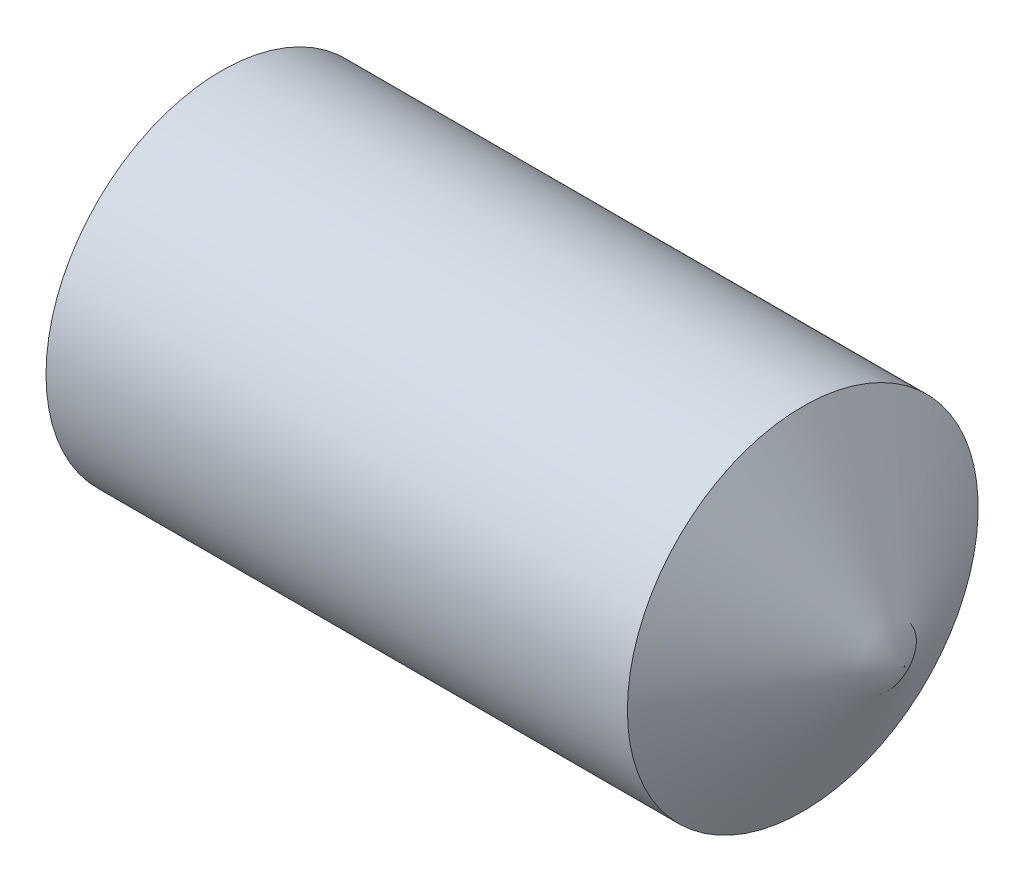
ISO-10303-21;
HEADER;
FILE_DESCRIPTION(('STEP AP214'),'2;1');
FILE_NAME('part.step','',(''),(''),'','','');
FILE_SCHEMA(('AUTOMOTIVE_DESIGN { 1 0 10303 214 1 1 1 1 }'));
ENDSEC;
DATA;
#1=APPLICATION_CONTEXT('core data for automotive mechanical design processes');
#2=APPLICATION_PROTOCOL_DEFINITION('international standard','automotive_design',2000,#1);
#3=PRODUCT_CONTEXT('',#1,'mechanical');
#4=PRODUCT('Part','Part','',(#3));
#5=PRODUCT_RELATED_PRODUCT_CATEGORY('part','',(#4));
#6=PRODUCT_DEFINITION_FORMATION('','',#4);
#7=PRODUCT_DEFINITION_CONTEXT('part definition',#1,'design');
#8=PRODUCT_DEFINITION('design','',#6,#7);
#9=PRODUCT_DEFINITION_SHAPE('','',#8);
#10=(LENGTH_UNIT() NAMED_UNIT(*) SI_UNIT(.MILLI.,.METRE.));
#11=(NAMED_UNIT(*) PLANE_ANGLE_UNIT() SI_UNIT($,.RADIAN.));
#12=(NAMED_UNIT(*) SI_UNIT($,.STERADIAN.) SOLID_ANGLE_UNIT());
#13=UNCERTAINTY_MEASURE_WITH_UNIT(LENGTH_MEASURE(1.E-05),#10,'distance_accuracy_value','');
#14=(GEOMETRIC_REPRESENTATION_CONTEXT(3) GLOBAL_UNCERTAINTY_ASSIGNED_CONTEXT((#13)) GLOBAL_UNIT_ASSIGNED_CONTEXT((#10,
#11,#12)) REPRESENTATION_CONTEXT('',''));
#15=CARTESIAN_POINT('',(0.,0.,0.));
#16=DIRECTION('',(0.,0.,1.));
#17=DIRECTION('',(1.,0.,0.));
#18=AXIS2_PLACEMENT_3D('',#15,#16,#17);
#19=CARTESIAN_POINT('',(0.,0.,0.));
#20=DIRECTION('',(-1.,0.,0.));
#21=DIRECTION('',(0.,0.,1.));
#22=AXIS2_PLACEMENT_3D('',#19,#20,#21);
#23=PLANE('',#22);
#24=CARTESIAN_POINT('',(0.,0.,0.));
#25=DIRECTION('',(-1.,0.,0.));
#26=DIRECTION('',(0.,0.,1.));
#27=AXIS2_PLACEMENT_3D('',#24,#25,#26);
#28=CIRCLE('',#27,1.2195);
#29=CARTESIAN_POINT('',(0.,0.,1.2195));
#30=VERTEX_POINT('',#29);
#31=EDGE_CURVE('E11',#30,#30,#28,.T.);
#32=ORIENTED_EDGE('',*,*,#31,.T.);
#33=EDGE_LOOP('',(#32));
#34=FACE_BOUND('',#33,.T.);
#35=DIRECTION('',(0.,0.,-1.));
#36=VECTOR('',#35,1.);
#37=CARTESIAN_POINT('',(0.,0.750000000000003,0.433012701892216));
#38=LINE('',#37,#36);
#39=CARTESIAN_POINT('',(0.,0.750000000000003,0.433012701892216));
#40=VERTEX_POINT('',#39);
#41=CARTESIAN_POINT('',(0.,0.750000000000003,-0.433012701892222));
#42=VERTEX_POINT('',#41);
#43=EDGE_CURVE('E95',#40,#42,#38,.T.);
#44=ORIENTED_EDGE('',*,*,#43,.F.);
#45=DIRECTION('',(0.,-0.866025403784439,0.5));
#46=VECTOR('',#45,1.);
#47=CARTESIAN_POINT('',(0.,0.750000000000003,0.433012701892216));
#48=LINE('',#47,#46);
#49=CARTESIAN_POINT('',(0.,0.,0.866025403784435));
#50=VERTEX_POINT('',#49);
#51=EDGE_CURVE('E48',#40,#50,#48,.T.);
#52=ORIENTED_EDGE('',*,*,#51,.T.);
#53=DIRECTION('',(0.,0.866025403784439,0.5));
#54=VECTOR('',#53,1.);
#55=CARTESIAN_POINT('',(0.,-0.749999999999996,0.433012701892216));
#56=LINE('',#55,#54);
#57=CARTESIAN_POINT('',(0.,-0.749999999999996,0.433012701892216));
#58=VERTEX_POINT('',#57);
#59=EDGE_CURVE('E101',#58,#50,#56,.T.);
#60=ORIENTED_EDGE('',*,*,#59,.F.);
#61=DIRECTION('',(0.,0.,-1.));
#62=VECTOR('',#61,1.);
#63=CARTESIAN_POINT('',(0.,-0.749999999999996,0.433012701892216));
#64=LINE('',#63,#62);
#65=CARTESIAN_POINT('',(0.,-0.749999999999996,-0.433012701892222));
#66=VERTEX_POINT('',#65);
#67=EDGE_CURVE('E121',#58,#66,#64,.T.);
#68=ORIENTED_EDGE('',*,*,#67,.T.);
#69=DIRECTION('',(0.,0.866025403784438,-0.500000000000001));
#70=VECTOR('',#69,1.);
#71=CARTESIAN_POINT('',(0.,-0.749999999999996,-0.433012701892222));
#72=LINE('',#71,#70);
#73=CARTESIAN_POINT('',(0.,0.,-0.866025403784441));
#74=VERTEX_POINT('',#73);
#75=EDGE_CURVE('E124',#66,#74,#72,.T.);
#76=ORIENTED_EDGE('',*,*,#75,.T.);
#77=DIRECTION('',(0.,-0.866025403784439,-0.5));
#78=VECTOR('',#77,1.);
#79=CARTESIAN_POINT('',(0.,0.750000000000003,-0.433012701892222));
#80=LINE('',#79,#78);
#81=EDGE_CURVE('E127',#42,#74,#80,.T.);
#82=ORIENTED_EDGE('',*,*,#81,.F.);
#83=EDGE_LOOP('',(#44,#52,#60,#68,#76,#82));
#84=FACE_BOUND('',#83,.T.);
#85=ADVANCED_FACE('F34',(#34,#84),#23,.T.);
#86=CARTESIAN_POINT('',(0.,0.,0.));
#87=DIRECTION('',(1.,0.,0.));
#88=DIRECTION('',(0.,0.,-1.));
#89=AXIS2_PLACEMENT_3D('',#86,#87,#88);
#90=CONICAL_SURFACE('',#89,1.2195,1.0471975511966);
#91=CARTESIAN_POINT('',(0.161946750507689,0.,0.));
#92=DIRECTION('',(-1.,0.,0.));
#93=DIRECTION('',(0.,0.,1.));
#94=AXIS2_PLACEMENT_3D('',#91,#92,#93);
#95=CIRCLE('',#94,1.5);
#96=CARTESIAN_POINT('',(0.161946750507689,0.,1.5));
#97=VERTEX_POINT('',#96);
#98=EDGE_CURVE('E41',#97,#97,#95,.T.);
#99=ORIENTED_EDGE('',*,*,#98,.T.);
#100=EDGE_LOOP('',(#99));
#101=FACE_BOUND('',#100,.T.);
#102=ORIENTED_EDGE('',*,*,#31,.F.);
#103=EDGE_LOOP('',(#102));
#104=FACE_BOUND('',#103,.T.);
#105=ADVANCED_FACE('F144',(#101,#104),#90,.T.);
#106=CARTESIAN_POINT('',(-12.7,0.,0.));
#107=DIRECTION('',(-1.,0.,0.));
#108=DIRECTION('',(0.,0.,1.));
#109=AXIS2_PLACEMENT_3D('',#106,#107,#108);
#110=CYLINDRICAL_SURFACE('',#109,1.5);
#111=CARTESIAN_POINT('',(5.13397459621557,0.,0.));
#112=DIRECTION('',(-1.,0.,0.));
#113=DIRECTION('',(0.,0.,1.));
#114=AXIS2_PLACEMENT_3D('',#111,#112,#113);
#115=CIRCLE('',#114,1.5);
#116=CARTESIAN_POINT('',(5.13397459621557,0.,1.5));
#117=VERTEX_POINT('',#116);
#118=EDGE_CURVE('E102',#117,#117,#115,.T.);
#119=ORIENTED_EDGE('',*,*,#118,.T.);
#120=EDGE_LOOP('',(#119));
#121=FACE_BOUND('',#120,.T.);
#122=ORIENTED_EDGE('',*,*,#98,.F.);
#123=EDGE_LOOP('',(#122));
#124=FACE_BOUND('',#123,.T.);
#125=ADVANCED_FACE('F147',(#121,#124),#110,.T.);
#126=CARTESIAN_POINT('',(5.13397459621557,0.,0.));
#127=DIRECTION('',(-1.,0.,0.));
#128=DIRECTION('',(0.,0.,1.));
#129=AXIS2_PLACEMENT_3D('',#126,#127,#128);
#130=CONICAL_SURFACE('',#129,1.5,1.0471975511966);
#131=CARTESIAN_POINT('',(6.,0.,0.));
#132=VERTEX_POINT('',#131);
#133=VERTEX_LOOP('',#132);
#134=FACE_BOUND('',#133,.T.);
#135=ORIENTED_EDGE('',*,*,#118,.F.);
#136=EDGE_LOOP('',(#135));
#137=FACE_BOUND('',#136,.T.);
#138=ADVANCED_FACE('F149',(#134,#137),#130,.T.);
#139=CARTESIAN_POINT('',(1.2,0.750000000000003,0.433012701892216));
#140=DIRECTION('',(0.,-0.5,-0.866025403784438));
#141=DIRECTION('',(0.,0.866025403784438,-0.5));
#142=AXIS2_PLACEMENT_3D('',#139,#140,#141);
#143=PLANE('',#142);
#144=ORIENTED_EDGE('',*,*,#51,.F.);
#145=DIRECTION('',(-1.,0.,0.));
#146=VECTOR('',#145,1.);
#147=CARTESIAN_POINT('',(1.2,0.750000000000003,0.433012701892216));
#148=LINE('',#147,#146);
#149=CARTESIAN_POINT('',(1.2,0.750000000000003,0.433012701892216));
#150=VERTEX_POINT('',#149);
#151=EDGE_CURVE('E89',#150,#40,#148,.T.);
#152=ORIENTED_EDGE('',*,*,#151,.F.);
#153=DIRECTION('',(0.,-0.866025403784439,0.5));
#154=VECTOR('',#153,1.);
#155=CARTESIAN_POINT('',(1.2,0.750000000000003,0.433012701892216));
#156=LINE('',#155,#154);
#157=CARTESIAN_POINT('',(1.2,0.,0.866025403784435));
#158=VERTEX_POINT('',#157);
#159=EDGE_CURVE('E84',#150,#158,#156,.T.);
#160=ORIENTED_EDGE('',*,*,#159,.T.);
#161=DIRECTION('',(-1.,0.,0.));
#162=VECTOR('',#161,1.);
#163=CARTESIAN_POINT('',(1.2,0.,0.866025403784435));
#164=LINE('',#163,#162);
#165=EDGE_CURVE('E87',#158,#50,#164,.T.);
#166=ORIENTED_EDGE('',*,*,#165,.T.);
#167=EDGE_LOOP('',(#144,#152,#160,#166));
#168=FACE_BOUND('',#167,.T.);
#169=ADVANCED_FACE('F86',(#168),#143,.T.);
#170=CARTESIAN_POINT('',(1.2,-0.749999999999996,0.433012701892216));
#171=DIRECTION('',(0.,-0.5,0.866025403784439));
#172=DIRECTION('',(0.,-0.866025403784439,-0.5));
#173=AXIS2_PLACEMENT_3D('',#170,#171,#172);
#174=PLANE('',#173);
#175=ORIENTED_EDGE('',*,*,#59,.T.);
#176=ORIENTED_EDGE('',*,*,#165,.F.);
#177=DIRECTION('',(0.,0.866025403784439,0.5));
#178=VECTOR('',#177,1.);
#179=CARTESIAN_POINT('',(1.2,-0.749999999999996,0.433012701892216));
#180=LINE('',#179,#178);
#181=CARTESIAN_POINT('',(1.2,-0.749999999999996,0.433012701892216));
#182=VERTEX_POINT('',#181);
#183=EDGE_CURVE('E94',#182,#158,#180,.T.);
#184=ORIENTED_EDGE('',*,*,#183,.F.);
#185=DIRECTION('',(-1.,0.,0.));
#186=VECTOR('',#185,1.);
#187=CARTESIAN_POINT('',(1.2,-0.749999999999996,0.433012701892216));
#188=LINE('',#187,#186);
#189=EDGE_CURVE('E103',#182,#58,#188,.T.);
#190=ORIENTED_EDGE('',*,*,#189,.T.);
#191=EDGE_LOOP('',(#175,#176,#184,#190));
#192=FACE_BOUND('',#191,.T.);
#193=ADVANCED_FACE('F99',(#192),#174,.F.);
#194=CARTESIAN_POINT('',(1.2,-0.749999999999996,0.433012701892216));
#195=DIRECTION('',(0.,1.,0.));
#196=DIRECTION('',(0.,0.,1.));
#197=AXIS2_PLACEMENT_3D('',#194,#195,#196);
#198=PLANE('',#197);
#199=ORIENTED_EDGE('',*,*,#67,.F.);
#200=ORIENTED_EDGE('',*,*,#189,.F.);
#201=DIRECTION('',(0.,0.,-1.));
#202=VECTOR('',#201,1.);
#203=CARTESIAN_POINT('',(1.2,-0.749999999999996,0.433012701892216));
#204=LINE('',#203,#202);
#205=CARTESIAN_POINT('',(1.2,-0.749999999999996,-0.433012701892222));
#206=VERTEX_POINT('',#205);
#207=EDGE_CURVE('E108',#182,#206,#204,.T.);
#208=ORIENTED_EDGE('',*,*,#207,.T.);
#209=DIRECTION('',(-1.,0.,0.));
#210=VECTOR('',#209,1.);
#211=CARTESIAN_POINT('',(1.2,-0.749999999999996,-0.433012701892222));
#212=LINE('',#211,#210);
#213=EDGE_CURVE('E137',#206,#66,#212,.T.);
#214=ORIENTED_EDGE('',*,*,#213,.T.);
#215=EDGE_LOOP('',(#199,#200,#208,#214));
#216=FACE_BOUND('',#215,.T.);
#217=ADVANCED_FACE('F177',(#216),#198,.T.);
#218=CARTESIAN_POINT('',(1.2,-0.749999999999996,-0.433012701892222));
#219=DIRECTION('',(0.,0.500000000000001,0.866025403784438));
#220=DIRECTION('',(0.,-0.866025403784438,0.500000000000001));
#221=AXIS2_PLACEMENT_3D('',#218,#219,#220);
#222=PLANE('',#221);
#223=ORIENTED_EDGE('',*,*,#75,.F.);
#224=ORIENTED_EDGE('',*,*,#213,.F.);
#225=DIRECTION('',(0.,0.866025403784438,-0.500000000000001));
#226=VECTOR('',#225,1.);
#227=CARTESIAN_POINT('',(1.2,-0.749999999999996,-0.433012701892222));
#228=LINE('',#227,#226);
#229=CARTESIAN_POINT('',(1.2,0.,-0.866025403784441));
#230=VERTEX_POINT('',#229);
#231=EDGE_CURVE('E110',#206,#230,#228,.T.);
#232=ORIENTED_EDGE('',*,*,#231,.T.);
#233=DIRECTION('',(-1.,0.,0.));
#234=VECTOR('',#233,1.);
#235=CARTESIAN_POINT('',(1.2,0.,-0.866025403784441));
#236=LINE('',#235,#234);
#237=EDGE_CURVE('E135',#230,#74,#236,.T.);
#238=ORIENTED_EDGE('',*,*,#237,.T.);
#239=EDGE_LOOP('',(#223,#224,#232,#238));
#240=FACE_BOUND('',#239,.T.);
#241=ADVANCED_FACE('F173',(#240),#222,.T.);
#242=CARTESIAN_POINT('',(1.2,0.750000000000003,-0.433012701892222));
#243=DIRECTION('',(0.,0.5,-0.866025403784439));
#244=DIRECTION('',(0.,0.866025403784439,0.5));
#245=AXIS2_PLACEMENT_3D('',#242,#243,#244);
#246=PLANE('',#245);
#247=ORIENTED_EDGE('',*,*,#81,.T.);
#248=ORIENTED_EDGE('',*,*,#237,.F.);
#249=DIRECTION('',(0.,-0.866025403784439,-0.5));
#250=VECTOR('',#249,1.);
#251=CARTESIAN_POINT('',(1.2,0.750000000000003,-0.433012701892222));
#252=LINE('',#251,#250);
#253=CARTESIAN_POINT('',(1.2,0.750000000000003,-0.433012701892222));
#254=VERTEX_POINT('',#253);
#255=EDGE_CURVE('E114',#254,#230,#252,.T.);
#256=ORIENTED_EDGE('',*,*,#255,.F.);
#257=DIRECTION('',(-1.,0.,0.));
#258=VECTOR('',#257,1.);
#259=CARTESIAN_POINT('',(1.2,0.750000000000003,-0.433012701892222));
#260=LINE('',#259,#258);
#261=EDGE_CURVE('E133',#254,#42,#260,.T.);
#262=ORIENTED_EDGE('',*,*,#261,.T.);
#263=EDGE_LOOP('',(#247,#248,#256,#262));
#264=FACE_BOUND('',#263,.T.);
#265=ADVANCED_FACE('F170',(#264),#246,.F.);
#266=CARTESIAN_POINT('',(1.2,0.750000000000003,0.433012701892216));
#267=DIRECTION('',(0.,1.,0.));
#268=DIRECTION('',(0.,0.,1.));
#269=AXIS2_PLACEMENT_3D('',#266,#267,#268);
#270=PLANE('',#269);
#271=ORIENTED_EDGE('',*,*,#43,.T.);
#272=ORIENTED_EDGE('',*,*,#261,.F.);
#273=DIRECTION('',(0.,0.,-1.));
#274=VECTOR('',#273,1.);
#275=CARTESIAN_POINT('',(1.2,0.750000000000003,0.433012701892216));
#276=LINE('',#275,#274);
#277=EDGE_CURVE('E117',#150,#254,#276,.T.);
#278=ORIENTED_EDGE('',*,*,#277,.F.);
#279=ORIENTED_EDGE('',*,*,#151,.T.);
#280=EDGE_LOOP('',(#271,#272,#278,#279));
#281=FACE_BOUND('',#280,.T.);
#282=ADVANCED_FACE('F166',(#281),#270,.F.);
#283=CARTESIAN_POINT('',(1.2,1.5,0.));
#284=DIRECTION('',(1.,0.,0.));
#285=DIRECTION('',(0.,0.,-1.));
#286=AXIS2_PLACEMENT_3D('',#283,#284,#285);
#287=PLANE('',#286);
#288=ORIENTED_EDGE('',*,*,#159,.F.);
#289=ORIENTED_EDGE('',*,*,#277,.T.);
#290=ORIENTED_EDGE('',*,*,#255,.T.);
#291=ORIENTED_EDGE('',*,*,#231,.F.);
#292=ORIENTED_EDGE('',*,*,#207,.F.);
#293=ORIENTED_EDGE('',*,*,#183,.T.);
#294=EDGE_LOOP('',(#288,#289,#290,#291,#292,#293));
#295=FACE_BOUND('',#294,.T.);
#296=ADVANCED_FACE('F106',(#295),#287,.F.);
#297=CLOSED_SHELL('',(#85,#105,#125,#138,#169,#193,#217,#241,#265,#282,#296));
#298=MANIFOLD_SOLID_BREP('B2',#297);
#299=ADVANCED_BREP_SHAPE_REPRESENTATION('',(#18,#298),#14);
#300=SHAPE_DEFINITION_REPRESENTATION(#9,#299);
ENDSEC;
END-ISO-10303-21;
